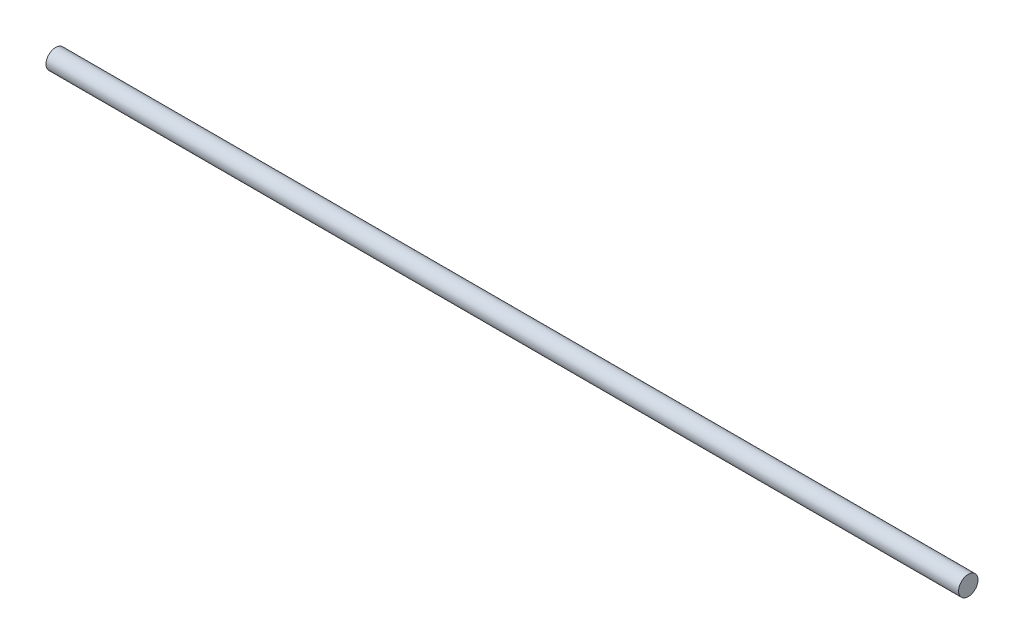
ISO-10303-21;
HEADER;
FILE_DESCRIPTION(('STEP AP214'),'2;1');
FILE_NAME('part.step','',(''),(''),'','','');
FILE_SCHEMA(('AUTOMOTIVE_DESIGN { 1 0 10303 214 1 1 1 1 }'));
ENDSEC;
DATA;
#1=APPLICATION_CONTEXT('core data for automotive mechanical design processes');
#2=APPLICATION_PROTOCOL_DEFINITION('international standard','automotive_design',2000,#1);
#3=PRODUCT_CONTEXT('',#1,'mechanical');
#4=PRODUCT('Part','Part','',(#3));
#5=PRODUCT_RELATED_PRODUCT_CATEGORY('part','',(#4));
#6=PRODUCT_DEFINITION_FORMATION('','',#4);
#7=PRODUCT_DEFINITION_CONTEXT('part definition',#1,'design');
#8=PRODUCT_DEFINITION('design','',#6,#7);
#9=PRODUCT_DEFINITION_SHAPE('','',#8);
#10=(LENGTH_UNIT() NAMED_UNIT(*) SI_UNIT(.MILLI.,.METRE.));
#11=(NAMED_UNIT(*) PLANE_ANGLE_UNIT() SI_UNIT($,.RADIAN.));
#12=(NAMED_UNIT(*) SI_UNIT($,.STERADIAN.) SOLID_ANGLE_UNIT());
#13=UNCERTAINTY_MEASURE_WITH_UNIT(LENGTH_MEASURE(1.E-05),#10,'distance_accuracy_value','');
#14=(GEOMETRIC_REPRESENTATION_CONTEXT(3) GLOBAL_UNCERTAINTY_ASSIGNED_CONTEXT((#13)) GLOBAL_UNIT_ASSIGNED_CONTEXT((#10,
#11,#12)) REPRESENTATION_CONTEXT('',''));
#15=CARTESIAN_POINT('',(0.,0.,0.));
#16=DIRECTION('',(0.,0.,1.));
#17=DIRECTION('',(1.,0.,0.));
#18=AXIS2_PLACEMENT_3D('',#15,#16,#17);
#19=CARTESIAN_POINT('',(-149.225,0.,0.));
#20=DIRECTION('',(1.,0.,0.));
#21=DIRECTION('',(0.,0.,-1.));
#22=AXIS2_PLACEMENT_3D('',#19,#20,#21);
#23=CYLINDRICAL_SURFACE('',#22,3.175);
#24=CARTESIAN_POINT('',(-149.225,0.,0.));
#25=DIRECTION('',(1.,0.,0.));
#26=DIRECTION('',(0.,0.,-1.));
#27=AXIS2_PLACEMENT_3D('',#24,#25,#26);
#28=CIRCLE('',#27,3.175);
#29=CARTESIAN_POINT('',(-149.225,0.,-3.175));
#30=VERTEX_POINT('',#29);
#31=EDGE_CURVE('E10',#30,#30,#28,.T.);
#32=ORIENTED_EDGE('',*,*,#31,.T.);
#33=EDGE_LOOP('',(#32));
#34=FACE_BOUND('',#33,.T.);
#35=CARTESIAN_POINT('',(149.225,0.,0.));
#36=DIRECTION('',(1.,0.,0.));
#37=DIRECTION('',(0.,0.,-1.));
#38=AXIS2_PLACEMENT_3D('',#35,#36,#37);
#39=CIRCLE('',#38,3.175);
#40=CARTESIAN_POINT('',(149.225,0.,-3.175));
#41=VERTEX_POINT('',#40);
#42=EDGE_CURVE('E41',#41,#41,#39,.T.);
#43=ORIENTED_EDGE('',*,*,#42,.F.);
#44=EDGE_LOOP('',(#43));
#45=FACE_BOUND('',#44,.T.);
#46=ADVANCED_FACE('F35',(#34,#45),#23,.T.);
#47=CARTESIAN_POINT('',(-149.225,0.,0.));
#48=DIRECTION('',(1.,0.,0.));
#49=DIRECTION('',(0.,0.,-1.));
#50=AXIS2_PLACEMENT_3D('',#47,#48,#49);
#51=PLANE('',#50);
#52=ORIENTED_EDGE('',*,*,#31,.F.);
#53=EDGE_LOOP('',(#52));
#54=FACE_BOUND('',#53,.T.);
#55=ADVANCED_FACE('F50',(#54),#51,.F.);
#56=CARTESIAN_POINT('',(149.225,0.,0.));
#57=DIRECTION('',(1.,0.,0.));
#58=DIRECTION('',(0.,0.,-1.));
#59=AXIS2_PLACEMENT_3D('',#56,#57,#58);
#60=PLANE('',#59);
#61=ORIENTED_EDGE('',*,*,#42,.T.);
#62=EDGE_LOOP('',(#61));
#63=FACE_BOUND('',#62,.T.);
#64=ADVANCED_FACE('F47',(#63),#60,.T.);
#65=CLOSED_SHELL('',(#46,#55,#64));
#66=MANIFOLD_SOLID_BREP('B2',#65);
#67=ADVANCED_BREP_SHAPE_REPRESENTATION('',(#18,#66),#14);
#68=SHAPE_DEFINITION_REPRESENTATION(#9,#67);
ENDSEC;
END-ISO-10303-21;
